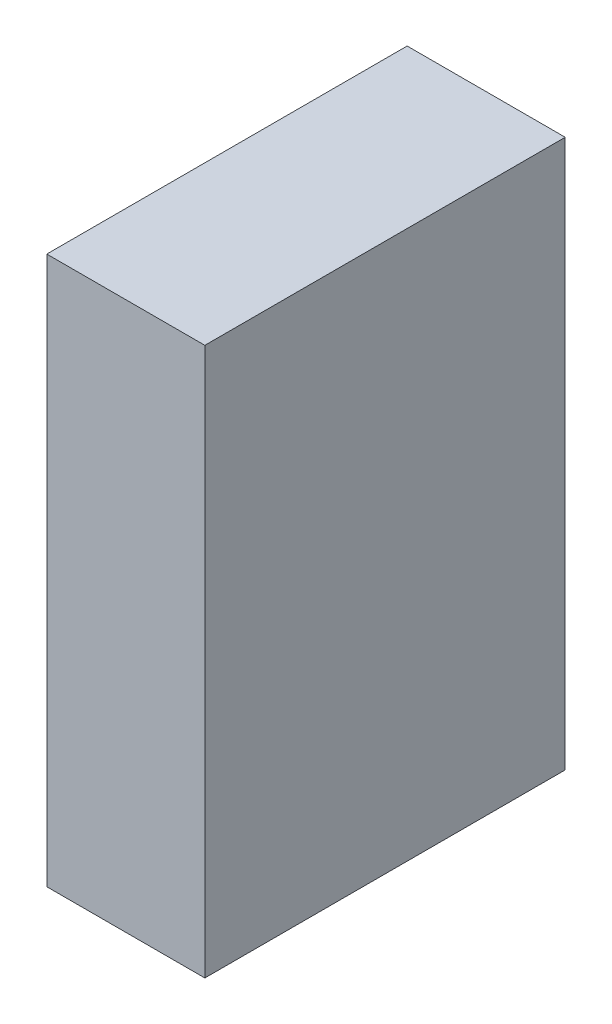
ISO-10303-21;
HEADER;
FILE_DESCRIPTION(('STEP AP214'),'2;1');
FILE_NAME('part.step','',(''),(''),'','','');
FILE_SCHEMA(('AUTOMOTIVE_DESIGN { 1 0 10303 214 1 1 1 1 }'));
ENDSEC;
DATA;
#1=APPLICATION_CONTEXT('core data for automotive mechanical design processes');
#2=APPLICATION_PROTOCOL_DEFINITION('international standard','automotive_design',2000,#1);
#3=PRODUCT_CONTEXT('',#1,'mechanical');
#4=PRODUCT('Part','Part','',(#3));
#5=PRODUCT_RELATED_PRODUCT_CATEGORY('part','',(#4));
#6=PRODUCT_DEFINITION_FORMATION('','',#4);
#7=PRODUCT_DEFINITION_CONTEXT('part definition',#1,'design');
#8=PRODUCT_DEFINITION('design','',#6,#7);
#9=PRODUCT_DEFINITION_SHAPE('','',#8);
#10=(LENGTH_UNIT() NAMED_UNIT(*) SI_UNIT(.MILLI.,.METRE.));
#11=(NAMED_UNIT(*) PLANE_ANGLE_UNIT() SI_UNIT($,.RADIAN.));
#12=(NAMED_UNIT(*) SI_UNIT($,.STERADIAN.) SOLID_ANGLE_UNIT());
#13=UNCERTAINTY_MEASURE_WITH_UNIT(LENGTH_MEASURE(1.E-05),#10,'distance_accuracy_value','');
#14=(GEOMETRIC_REPRESENTATION_CONTEXT(3) GLOBAL_UNCERTAINTY_ASSIGNED_CONTEXT((#13)) GLOBAL_UNIT_ASSIGNED_CONTEXT((#10,
#11,#12)) REPRESENTATION_CONTEXT('',''));
#15=CARTESIAN_POINT('',(0.,0.,0.));
#16=DIRECTION('',(0.,0.,1.));
#17=DIRECTION('',(1.,0.,0.));
#18=AXIS2_PLACEMENT_3D('',#15,#16,#17);
#19=CARTESIAN_POINT('',(-0.18750026,-0.65000124,0.));
#20=DIRECTION('',(-1.,0.,0.));
#21=DIRECTION('',(0.,0.,1.));
#22=AXIS2_PLACEMENT_3D('',#19,#20,#21);
#23=PLANE('',#22);
#24=DIRECTION('',(0.,0.,1.));
#25=VECTOR('',#24,1.);
#26=CARTESIAN_POINT('',(-0.18750026,0.65000124,0.));
#27=LINE('',#26,#25);
#28=CARTESIAN_POINT('',(-0.18750026,0.65000124,0.));
#29=VERTEX_POINT('',#28);
#30=CARTESIAN_POINT('',(-0.18750026,0.65000124,0.85499956));
#31=VERTEX_POINT('',#30);
#32=EDGE_CURVE('E20',#29,#31,#27,.T.);
#33=ORIENTED_EDGE('',*,*,#32,.F.);
#34=DIRECTION('',(0.,1.,0.));
#35=VECTOR('',#34,1.);
#36=CARTESIAN_POINT('',(-0.18750026,0.65000124,0.));
#37=LINE('',#36,#35);
#38=CARTESIAN_POINT('',(-0.18750026,-0.65000124,0.));
#39=VERTEX_POINT('',#38);
#40=EDGE_CURVE('E80',#29,#39,#37,.F.);
#41=ORIENTED_EDGE('',*,*,#40,.T.);
#42=DIRECTION('',(0.,0.,-1.));
#43=VECTOR('',#42,1.);
#44=CARTESIAN_POINT('',(-0.18750026,-0.65000124,0.));
#45=LINE('',#44,#43);
#46=CARTESIAN_POINT('',(-0.18750026,-0.65000124,0.85499956));
#47=VERTEX_POINT('',#46);
#48=EDGE_CURVE('E68',#47,#39,#45,.T.);
#49=ORIENTED_EDGE('',*,*,#48,.F.);
#50=DIRECTION('',(0.,1.,0.));
#51=VECTOR('',#50,1.);
#52=CARTESIAN_POINT('',(-0.18750026,0.65000124,0.85499956));
#53=LINE('',#52,#51);
#54=EDGE_CURVE('E56',#31,#47,#53,.F.);
#55=ORIENTED_EDGE('',*,*,#54,.F.);
#56=EDGE_LOOP('',(#33,#41,#49,#55));
#57=FACE_BOUND('',#56,.T.);
#58=ADVANCED_FACE('F17',(#57),#23,.T.);
#59=CARTESIAN_POINT('',(-0.18750026,0.65000124,0.));
#60=DIRECTION('',(0.,1.,0.));
#61=DIRECTION('',(0.,0.,1.));
#62=AXIS2_PLACEMENT_3D('',#59,#60,#61);
#63=PLANE('',#62);
#64=DIRECTION('',(0.,0.,-1.));
#65=VECTOR('',#64,1.);
#66=CARTESIAN_POINT('',(0.18750026,0.65000124,0.));
#67=LINE('',#66,#65);
#68=CARTESIAN_POINT('',(0.18750026,0.65000124,0.));
#69=VERTEX_POINT('',#68);
#70=CARTESIAN_POINT('',(0.18750026,0.65000124,0.85499956));
#71=VERTEX_POINT('',#70);
#72=EDGE_CURVE('E83',#69,#71,#67,.F.);
#73=ORIENTED_EDGE('',*,*,#72,.F.);
#74=DIRECTION('',(1.,0.,0.));
#75=VECTOR('',#74,1.);
#76=CARTESIAN_POINT('',(0.18750026,0.65000124,0.));
#77=LINE('',#76,#75);
#78=EDGE_CURVE('E65',#69,#29,#77,.F.);
#79=ORIENTED_EDGE('',*,*,#78,.T.);
#80=ORIENTED_EDGE('',*,*,#32,.T.);
#81=DIRECTION('',(1.,0.,0.));
#82=VECTOR('',#81,1.);
#83=CARTESIAN_POINT('',(0.18750026,0.65000124,0.85499956));
#84=LINE('',#83,#82);
#85=EDGE_CURVE('E62',#71,#31,#84,.F.);
#86=ORIENTED_EDGE('',*,*,#85,.F.);
#87=EDGE_LOOP('',(#73,#79,#80,#86));
#88=FACE_BOUND('',#87,.T.);
#89=ADVANCED_FACE('F61',(#88),#63,.T.);
#90=CARTESIAN_POINT('',(0.18750026,0.65000124,0.85499956));
#91=DIRECTION('',(0.,0.,1.));
#92=DIRECTION('',(1.,0.,0.));
#93=AXIS2_PLACEMENT_3D('',#90,#91,#92);
#94=PLANE('',#93);
#95=DIRECTION('',(1.,0.,0.));
#96=VECTOR('',#95,1.);
#97=CARTESIAN_POINT('',(0.18750026,-0.65000124,0.85499956));
#98=LINE('',#97,#96);
#99=CARTESIAN_POINT('',(0.18750026,-0.65000124,0.85499956));
#100=VERTEX_POINT('',#99);
#101=EDGE_CURVE('E70',#100,#47,#98,.F.);
#102=ORIENTED_EDGE('',*,*,#101,.F.);
#103=DIRECTION('',(0.,1.,0.));
#104=VECTOR('',#103,1.);
#105=CARTESIAN_POINT('',(0.18750026,0.65000124,0.85499956));
#106=LINE('',#105,#104);
#107=EDGE_CURVE('E74',#71,#100,#106,.F.);
#108=ORIENTED_EDGE('',*,*,#107,.F.);
#109=ORIENTED_EDGE('',*,*,#85,.T.);
#110=ORIENTED_EDGE('',*,*,#54,.T.);
#111=EDGE_LOOP('',(#102,#108,#109,#110));
#112=FACE_BOUND('',#111,.T.);
#113=ADVANCED_FACE('F72',(#112),#94,.T.);
#114=CARTESIAN_POINT('',(0.18750026,-0.65000124,0.));
#115=DIRECTION('',(0.,-1.,0.));
#116=DIRECTION('',(0.,0.,-1.));
#117=AXIS2_PLACEMENT_3D('',#114,#115,#116);
#118=PLANE('',#117);
#119=ORIENTED_EDGE('',*,*,#48,.T.);
#120=DIRECTION('',(1.,0.,0.));
#121=VECTOR('',#120,1.);
#122=CARTESIAN_POINT('',(0.18750026,-0.65000124,0.));
#123=LINE('',#122,#121);
#124=CARTESIAN_POINT('',(0.18750026,-0.65000124,0.));
#125=VERTEX_POINT('',#124);
#126=EDGE_CURVE('E35',#39,#125,#123,.T.);
#127=ORIENTED_EDGE('',*,*,#126,.T.);
#128=DIRECTION('',(0.,0.,-1.));
#129=VECTOR('',#128,1.);
#130=CARTESIAN_POINT('',(0.18750026,-0.65000124,0.));
#131=LINE('',#130,#129);
#132=EDGE_CURVE('E26',#100,#125,#131,.T.);
#133=ORIENTED_EDGE('',*,*,#132,.F.);
#134=ORIENTED_EDGE('',*,*,#101,.T.);
#135=EDGE_LOOP('',(#119,#127,#133,#134));
#136=FACE_BOUND('',#135,.T.);
#137=ADVANCED_FACE('F89',(#136),#118,.T.);
#138=CARTESIAN_POINT('',(0.18750026,0.65000124,0.));
#139=DIRECTION('',(0.,0.,1.));
#140=DIRECTION('',(1.,0.,0.));
#141=AXIS2_PLACEMENT_3D('',#138,#139,#140);
#142=PLANE('',#141);
#143=ORIENTED_EDGE('',*,*,#126,.F.);
#144=ORIENTED_EDGE('',*,*,#40,.F.);
#145=ORIENTED_EDGE('',*,*,#78,.F.);
#146=DIRECTION('',(0.,1.,0.));
#147=VECTOR('',#146,1.);
#148=CARTESIAN_POINT('',(0.18750026,0.65000124,0.));
#149=LINE('',#148,#147);
#150=EDGE_CURVE('E11',#125,#69,#149,.T.);
#151=ORIENTED_EDGE('',*,*,#150,.F.);
#152=EDGE_LOOP('',(#143,#144,#145,#151));
#153=FACE_BOUND('',#152,.T.);
#154=ADVANCED_FACE('F91',(#153),#142,.F.);
#155=CARTESIAN_POINT('',(0.18750026,0.65000124,0.));
#156=DIRECTION('',(1.,0.,0.));
#157=DIRECTION('',(0.,0.,-1.));
#158=AXIS2_PLACEMENT_3D('',#155,#156,#157);
#159=PLANE('',#158);
#160=ORIENTED_EDGE('',*,*,#132,.T.);
#161=ORIENTED_EDGE('',*,*,#150,.T.);
#162=ORIENTED_EDGE('',*,*,#72,.T.);
#163=ORIENTED_EDGE('',*,*,#107,.T.);
#164=EDGE_LOOP('',(#160,#161,#162,#163));
#165=FACE_BOUND('',#164,.T.);
#166=ADVANCED_FACE('F88',(#165),#159,.T.);
#167=CLOSED_SHELL('',(#58,#89,#113,#137,#154,#166));
#168=MANIFOLD_SOLID_BREP('B1',#167);
#169=ADVANCED_BREP_SHAPE_REPRESENTATION('',(#18,#168),#14);
#170=SHAPE_DEFINITION_REPRESENTATION(#9,#169);
ENDSEC;
END-ISO-10303-21;
